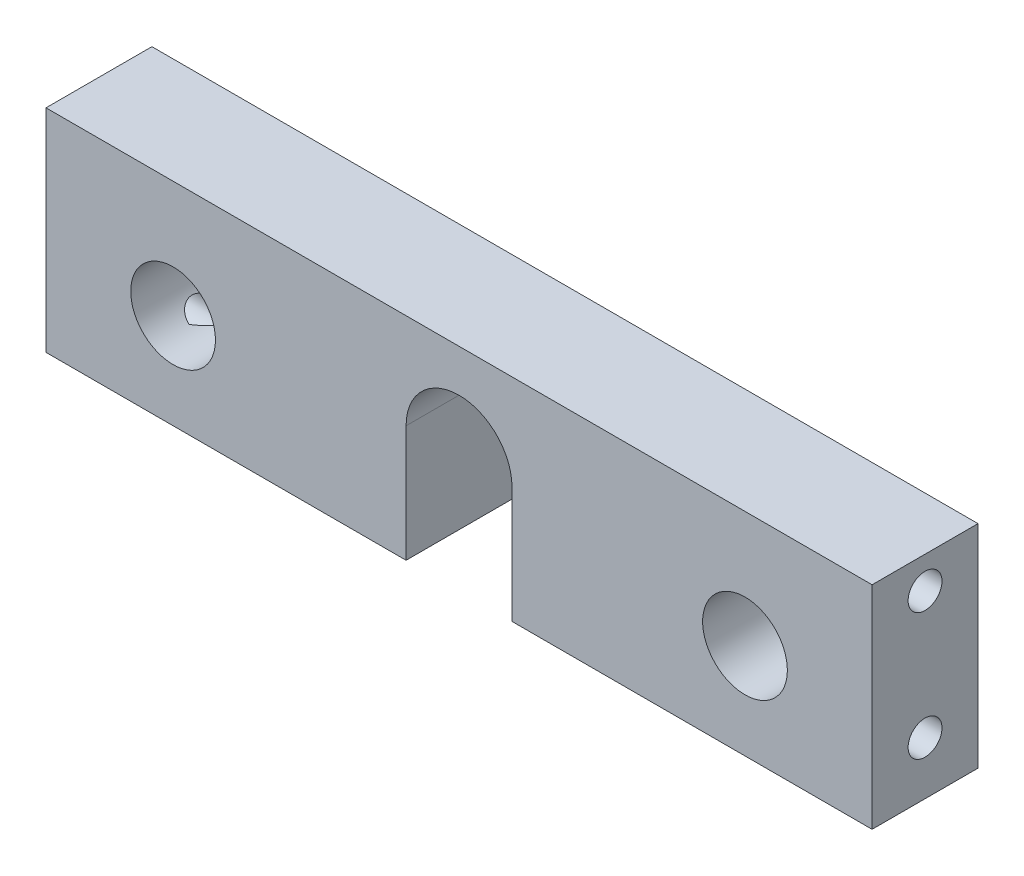
ISO-10303-21;
HEADER;
FILE_DESCRIPTION(('STEP AP214'),'2;1');
FILE_NAME('part.step','',(''),(''),'','','');
FILE_SCHEMA(('AUTOMOTIVE_DESIGN { 1 0 10303 214 1 1 1 1 }'));
ENDSEC;
DATA;
#1=APPLICATION_CONTEXT('core data for automotive mechanical design processes');
#2=APPLICATION_PROTOCOL_DEFINITION('international standard','automotive_design',2000,#1);
#3=PRODUCT_CONTEXT('',#1,'mechanical');
#4=PRODUCT('Part','Part','',(#3));
#5=PRODUCT_RELATED_PRODUCT_CATEGORY('part','',(#4));
#6=PRODUCT_DEFINITION_FORMATION('','',#4);
#7=PRODUCT_DEFINITION_CONTEXT('part definition',#1,'design');
#8=PRODUCT_DEFINITION('design','',#6,#7);
#9=PRODUCT_DEFINITION_SHAPE('','',#8);
#10=(LENGTH_UNIT() NAMED_UNIT(*) SI_UNIT(.MILLI.,.METRE.));
#11=(NAMED_UNIT(*) PLANE_ANGLE_UNIT() SI_UNIT($,.RADIAN.));
#12=(NAMED_UNIT(*) SI_UNIT($,.STERADIAN.) SOLID_ANGLE_UNIT());
#13=UNCERTAINTY_MEASURE_WITH_UNIT(LENGTH_MEASURE(1.E-05),#10,'distance_accuracy_value','');
#14=(GEOMETRIC_REPRESENTATION_CONTEXT(3) GLOBAL_UNCERTAINTY_ASSIGNED_CONTEXT((#13)) GLOBAL_UNIT_ASSIGNED_CONTEXT((#10,
#11,#12)) REPRESENTATION_CONTEXT('',''));
#15=CARTESIAN_POINT('',(0.,0.,0.));
#16=DIRECTION('',(0.,0.,1.));
#17=DIRECTION('',(1.,0.,0.));
#18=AXIS2_PLACEMENT_3D('',#15,#16,#17);
#19=CARTESIAN_POINT('',(39.,0.,2.5));
#20=DIRECTION('',(0.,1.,0.));
#21=DIRECTION('',(0.,0.,1.));
#22=AXIS2_PLACEMENT_3D('',#19,#20,#21);
#23=PLANE('',#22);
#24=DIRECTION('',(-1.,0.,0.));
#25=VECTOR('',#24,1.);
#26=CARTESIAN_POINT('',(39.,0.,-2.5));
#27=LINE('',#26,#25);
#28=CARTESIAN_POINT('',(17.,0.,-2.5));
#29=VERTEX_POINT('',#28);
#30=CARTESIAN_POINT('',(0.,0.,-2.5));
#31=VERTEX_POINT('',#30);
#32=EDGE_CURVE('E146',#29,#31,#27,.T.);
#33=ORIENTED_EDGE('',*,*,#32,.F.);
#34=DIRECTION('',(0.,0.,1.));
#35=VECTOR('',#34,1.);
#36=CARTESIAN_POINT('',(17.,0.,-2.501));
#37=LINE('',#36,#35);
#38=CARTESIAN_POINT('',(17.,0.,2.5));
#39=VERTEX_POINT('',#38);
#40=EDGE_CURVE('E133',#29,#39,#37,.T.);
#41=ORIENTED_EDGE('',*,*,#40,.T.);
#42=DIRECTION('',(-1.,0.,0.));
#43=VECTOR('',#42,1.);
#44=CARTESIAN_POINT('',(39.,0.,2.5));
#45=LINE('',#44,#43);
#46=CARTESIAN_POINT('',(0.,0.,2.5));
#47=VERTEX_POINT('',#46);
#48=EDGE_CURVE('E43',#39,#47,#45,.T.);
#49=ORIENTED_EDGE('',*,*,#48,.T.);
#50=DIRECTION('',(0.,0.,-1.));
#51=VECTOR('',#50,1.);
#52=CARTESIAN_POINT('',(0.,0.,2.5));
#53=LINE('',#52,#51);
#54=EDGE_CURVE('E160',#47,#31,#53,.T.);
#55=ORIENTED_EDGE('',*,*,#54,.T.);
#56=EDGE_LOOP('',(#33,#41,#49,#55));
#57=FACE_BOUND('',#56,.T.);
#58=ADVANCED_FACE('F35',(#57),#23,.F.);
#59=CARTESIAN_POINT('',(39.,0.,2.5));
#60=DIRECTION('',(0.,0.,-1.));
#61=DIRECTION('',(0.,1.,0.));
#62=AXIS2_PLACEMENT_3D('',#59,#60,#61);
#63=PLANE('',#62);
#64=CARTESIAN_POINT('',(33.,4.5,2.5));
#65=DIRECTION('',(0.,0.,1.));
#66=DIRECTION('',(1.,0.,0.));
#67=AXIS2_PLACEMENT_3D('',#64,#65,#66);
#68=CIRCLE('',#67,2.);
#69=CARTESIAN_POINT('',(35.,4.5,2.5));
#70=VERTEX_POINT('',#69);
#71=EDGE_CURVE('E132',#70,#70,#68,.T.);
#72=ORIENTED_EDGE('',*,*,#71,.F.);
#73=EDGE_LOOP('',(#72));
#74=FACE_BOUND('',#73,.T.);
#75=CARTESIAN_POINT('',(6.,4.5,2.5));
#76=DIRECTION('',(0.,0.,1.));
#77=DIRECTION('',(1.,0.,0.));
#78=AXIS2_PLACEMENT_3D('',#75,#76,#77);
#79=CIRCLE('',#78,2.);
#80=CARTESIAN_POINT('',(8.,4.5,2.5));
#81=VERTEX_POINT('',#80);
#82=EDGE_CURVE('E239',#81,#81,#79,.T.);
#83=ORIENTED_EDGE('',*,*,#82,.F.);
#84=EDGE_LOOP('',(#83));
#85=FACE_BOUND('',#84,.T.);
#86=ORIENTED_EDGE('',*,*,#48,.F.);
#87=DIRECTION('',(0.,-1.,0.));
#88=VECTOR('',#87,1.);
#89=CARTESIAN_POINT('',(17.,0.,2.5));
#90=LINE('',#89,#88);
#91=CARTESIAN_POINT('',(17.,5.5,2.5));
#92=VERTEX_POINT('',#91);
#93=EDGE_CURVE('E141',#92,#39,#90,.T.);
#94=ORIENTED_EDGE('',*,*,#93,.F.);
#95=CARTESIAN_POINT('',(19.5,5.5,2.5));
#96=DIRECTION('',(0.,0.,1.));
#97=DIRECTION('',(-1.,0.,0.));
#98=AXIS2_PLACEMENT_3D('',#95,#96,#97);
#99=CIRCLE('',#98,2.5);
#100=CARTESIAN_POINT('',(22.,5.5,2.5));
#101=VERTEX_POINT('',#100);
#102=EDGE_CURVE('E309',#101,#92,#99,.T.);
#103=ORIENTED_EDGE('',*,*,#102,.F.);
#104=DIRECTION('',(0.,1.,0.));
#105=VECTOR('',#104,1.);
#106=CARTESIAN_POINT('',(22.,5.5,2.5));
#107=LINE('',#106,#105);
#108=CARTESIAN_POINT('',(22.,0.,2.5));
#109=VERTEX_POINT('',#108);
#110=EDGE_CURVE('E307',#109,#101,#107,.T.);
#111=ORIENTED_EDGE('',*,*,#110,.F.);
#112=CARTESIAN_POINT('',(39.,0.,2.5));
#113=VERTEX_POINT('',#112);
#114=EDGE_CURVE('E11',#113,#109,#45,.T.);
#115=ORIENTED_EDGE('',*,*,#114,.F.);
#116=DIRECTION('',(0.,-1.,0.));
#117=VECTOR('',#116,1.);
#118=CARTESIAN_POINT('',(39.,0.,2.5));
#119=LINE('',#118,#117);
#120=CARTESIAN_POINT('',(39.,10.,2.5));
#121=VERTEX_POINT('',#120);
#122=EDGE_CURVE('E157',#121,#113,#119,.T.);
#123=ORIENTED_EDGE('',*,*,#122,.F.);
#124=DIRECTION('',(-1.,0.,0.));
#125=VECTOR('',#124,1.);
#126=CARTESIAN_POINT('',(39.,10.,2.5));
#127=LINE('',#126,#125);
#128=CARTESIAN_POINT('',(0.,10.,2.5));
#129=VERTEX_POINT('',#128);
#130=EDGE_CURVE('E151',#121,#129,#127,.T.);
#131=ORIENTED_EDGE('',*,*,#130,.T.);
#132=DIRECTION('',(0.,-1.,0.));
#133=VECTOR('',#132,1.);
#134=CARTESIAN_POINT('',(0.,0.,2.5));
#135=LINE('',#134,#133);
#136=EDGE_CURVE('E163',#129,#47,#135,.T.);
#137=ORIENTED_EDGE('',*,*,#136,.T.);
#138=EDGE_LOOP('',(#86,#94,#103,#111,#115,#123,#131,#137));
#139=FACE_BOUND('',#138,.T.);
#140=ADVANCED_FACE('F37',(#74,#85,#139),#63,.F.);
#141=ORIENTED_EDGE('',*,*,#114,.T.);
#142=DIRECTION('',(0.,0.,1.));
#143=VECTOR('',#142,1.);
#144=CARTESIAN_POINT('',(22.,0.,-2.501));
#145=LINE('',#144,#143);
#146=CARTESIAN_POINT('',(22.,0.,-2.5));
#147=VERTEX_POINT('',#146);
#148=EDGE_CURVE('E127',#147,#109,#145,.T.);
#149=ORIENTED_EDGE('',*,*,#148,.F.);
#150=CARTESIAN_POINT('',(39.,0.,-2.5));
#151=VERTEX_POINT('',#150);
#152=EDGE_CURVE('E138',#151,#147,#27,.T.);
#153=ORIENTED_EDGE('',*,*,#152,.F.);
#154=DIRECTION('',(0.,0.,-1.));
#155=VECTOR('',#154,1.);
#156=CARTESIAN_POINT('',(39.,0.,2.5));
#157=LINE('',#156,#155);
#158=EDGE_CURVE('E169',#113,#151,#157,.T.);
#159=ORIENTED_EDGE('',*,*,#158,.F.);
#160=EDGE_LOOP('',(#141,#149,#153,#159));
#161=FACE_BOUND('',#160,.T.);
#162=ADVANCED_FACE('F137',(#161),#23,.F.);
#163=CARTESIAN_POINT('',(39.,10.,-2.5));
#164=DIRECTION('',(0.,0.,1.));
#165=DIRECTION('',(0.,-1.,0.));
#166=AXIS2_PLACEMENT_3D('',#163,#164,#165);
#167=PLANE('',#166);
#168=CARTESIAN_POINT('',(33.,4.5,-2.5));
#169=DIRECTION('',(0.,0.,1.));
#170=DIRECTION('',(0.,-1.,0.));
#171=AXIS2_PLACEMENT_3D('',#168,#169,#170);
#172=CIRCLE('',#171,2.);
#173=CARTESIAN_POINT('',(33.,2.5,-2.5));
#174=VERTEX_POINT('',#173);
#175=EDGE_CURVE('E237',#174,#174,#172,.F.);
#176=ORIENTED_EDGE('',*,*,#175,.F.);
#177=EDGE_LOOP('',(#176));
#178=FACE_BOUND('',#177,.T.);
#179=CARTESIAN_POINT('',(6.,4.5,-2.5));
#180=DIRECTION('',(0.,0.,1.));
#181=DIRECTION('',(0.,-1.,0.));
#182=AXIS2_PLACEMENT_3D('',#179,#180,#181);
#183=CIRCLE('',#182,2.);
#184=CARTESIAN_POINT('',(6.,2.5,-2.5));
#185=VERTEX_POINT('',#184);
#186=EDGE_CURVE('E196',#185,#185,#183,.F.);
#187=ORIENTED_EDGE('',*,*,#186,.F.);
#188=EDGE_LOOP('',(#187));
#189=FACE_BOUND('',#188,.T.);
#190=CARTESIAN_POINT('',(19.5,5.5,-2.5));
#191=DIRECTION('',(0.,0.,1.));
#192=DIRECTION('',(0.,-1.,0.));
#193=AXIS2_PLACEMENT_3D('',#190,#191,#192);
#194=CIRCLE('',#193,2.5);
#195=CARTESIAN_POINT('',(17.,5.5,-2.5));
#196=VERTEX_POINT('',#195);
#197=CARTESIAN_POINT('',(22.,5.5,-2.5));
#198=VERTEX_POINT('',#197);
#199=EDGE_CURVE('E50',#196,#198,#194,.F.);
#200=ORIENTED_EDGE('',*,*,#199,.F.);
#201=DIRECTION('',(0.,1.,0.));
#202=VECTOR('',#201,1.);
#203=CARTESIAN_POINT('',(17.,0.,-2.5));
#204=LINE('',#203,#202);
#205=EDGE_CURVE('E279',#29,#196,#204,.T.);
#206=ORIENTED_EDGE('',*,*,#205,.F.);
#207=ORIENTED_EDGE('',*,*,#32,.T.);
#208=DIRECTION('',(0.,1.,0.));
#209=VECTOR('',#208,1.);
#210=CARTESIAN_POINT('',(0.,10.,-2.5));
#211=LINE('',#210,#209);
#212=CARTESIAN_POINT('',(0.,10.,-2.5));
#213=VERTEX_POINT('',#212);
#214=EDGE_CURVE('E158',#31,#213,#211,.T.);
#215=ORIENTED_EDGE('',*,*,#214,.T.);
#216=DIRECTION('',(-1.,0.,0.));
#217=VECTOR('',#216,1.);
#218=CARTESIAN_POINT('',(39.,10.,-2.5));
#219=LINE('',#218,#217);
#220=CARTESIAN_POINT('',(39.,10.,-2.5));
#221=VERTEX_POINT('',#220);
#222=EDGE_CURVE('E147',#221,#213,#219,.T.);
#223=ORIENTED_EDGE('',*,*,#222,.F.);
#224=DIRECTION('',(0.,1.,0.));
#225=VECTOR('',#224,1.);
#226=CARTESIAN_POINT('',(39.,10.,-2.5));
#227=LINE('',#226,#225);
#228=EDGE_CURVE('E145',#151,#221,#227,.T.);
#229=ORIENTED_EDGE('',*,*,#228,.F.);
#230=ORIENTED_EDGE('',*,*,#152,.T.);
#231=DIRECTION('',(0.,-1.,0.));
#232=VECTOR('',#231,1.);
#233=CARTESIAN_POINT('',(22.,5.5,-2.5));
#234=LINE('',#233,#232);
#235=EDGE_CURVE('E123',#198,#147,#234,.T.);
#236=ORIENTED_EDGE('',*,*,#235,.F.);
#237=EDGE_LOOP('',(#200,#206,#207,#215,#223,#229,#230,#236));
#238=FACE_BOUND('',#237,.T.);
#239=ADVANCED_FACE('F143',(#178,#189,#238),#167,.F.);
#240=CARTESIAN_POINT('',(39.,10.,2.5));
#241=DIRECTION('',(0.,-1.,0.));
#242=DIRECTION('',(0.,0.,-1.));
#243=AXIS2_PLACEMENT_3D('',#240,#241,#242);
#244=PLANE('',#243);
#245=DIRECTION('',(0.,0.,1.));
#246=VECTOR('',#245,1.);
#247=CARTESIAN_POINT('',(0.,10.,2.5));
#248=LINE('',#247,#246);
#249=EDGE_CURVE('E155',#213,#129,#248,.T.);
#250=ORIENTED_EDGE('',*,*,#249,.T.);
#251=ORIENTED_EDGE('',*,*,#130,.F.);
#252=DIRECTION('',(0.,0.,1.));
#253=VECTOR('',#252,1.);
#254=CARTESIAN_POINT('',(39.,10.,2.5));
#255=LINE('',#254,#253);
#256=EDGE_CURVE('E154',#221,#121,#255,.T.);
#257=ORIENTED_EDGE('',*,*,#256,.F.);
#258=ORIENTED_EDGE('',*,*,#222,.T.);
#259=EDGE_LOOP('',(#250,#251,#257,#258));
#260=FACE_BOUND('',#259,.T.);
#261=ADVANCED_FACE('F275',(#260),#244,.F.);
#262=CARTESIAN_POINT('',(39.,0.,0.));
#263=DIRECTION('',(-1.,0.,0.));
#264=DIRECTION('',(0.,0.,1.));
#265=AXIS2_PLACEMENT_3D('',#262,#263,#264);
#266=PLANE('',#265);
#267=CARTESIAN_POINT('',(39.,8.5,0.));
#268=DIRECTION('',(1.,0.,0.));
#269=DIRECTION('',(0.,0.,-1.));
#270=AXIS2_PLACEMENT_3D('',#267,#268,#269);
#271=CIRCLE('',#270,0.79999999999999);
#272=CARTESIAN_POINT('',(39.,8.5,-0.79999999999999));
#273=VERTEX_POINT('',#272);
#274=EDGE_CURVE('E181',#273,#273,#271,.T.);
#275=ORIENTED_EDGE('',*,*,#274,.F.);
#276=EDGE_LOOP('',(#275));
#277=FACE_BOUND('',#276,.T.);
#278=CARTESIAN_POINT('',(39.,2.5,0.));
#279=DIRECTION('',(1.,0.,0.));
#280=DIRECTION('',(0.,0.,-1.));
#281=AXIS2_PLACEMENT_3D('',#278,#279,#280);
#282=CIRCLE('',#281,0.79999999999999);
#283=CARTESIAN_POINT('',(39.,2.5,-0.79999999999999));
#284=VERTEX_POINT('',#283);
#285=EDGE_CURVE('E175',#284,#284,#282,.T.);
#286=ORIENTED_EDGE('',*,*,#285,.F.);
#287=EDGE_LOOP('',(#286));
#288=FACE_BOUND('',#287,.T.);
#289=ORIENTED_EDGE('',*,*,#122,.T.);
#290=ORIENTED_EDGE('',*,*,#158,.T.);
#291=ORIENTED_EDGE('',*,*,#228,.T.);
#292=ORIENTED_EDGE('',*,*,#256,.T.);
#293=EDGE_LOOP('',(#289,#290,#291,#292));
#294=FACE_BOUND('',#293,.T.);
#295=ADVANCED_FACE('F261',(#277,#288,#294),#266,.F.);
#296=CARTESIAN_POINT('',(0.,0.,0.));
#297=DIRECTION('',(-1.,0.,0.));
#298=DIRECTION('',(0.,0.,1.));
#299=AXIS2_PLACEMENT_3D('',#296,#297,#298);
#300=PLANE('',#299);
#301=CARTESIAN_POINT('',(0.,8.5,0.));
#302=DIRECTION('',(-1.,0.,0.));
#303=DIRECTION('',(0.,0.,1.));
#304=AXIS2_PLACEMENT_3D('',#301,#302,#303);
#305=CIRCLE('',#304,0.79999999999999);
#306=CARTESIAN_POINT('',(0.,8.5,0.79999999999999));
#307=VERTEX_POINT('',#306);
#308=EDGE_CURVE('E193',#307,#307,#305,.T.);
#309=ORIENTED_EDGE('',*,*,#308,.F.);
#310=EDGE_LOOP('',(#309));
#311=FACE_BOUND('',#310,.T.);
#312=CARTESIAN_POINT('',(0.,2.5,0.));
#313=DIRECTION('',(-1.,0.,0.));
#314=DIRECTION('',(0.,0.,1.));
#315=AXIS2_PLACEMENT_3D('',#312,#313,#314);
#316=CIRCLE('',#315,0.79999999999999);
#317=CARTESIAN_POINT('',(0.,2.5,0.79999999999999));
#318=VERTEX_POINT('',#317);
#319=EDGE_CURVE('E187',#318,#318,#316,.T.);
#320=ORIENTED_EDGE('',*,*,#319,.F.);
#321=EDGE_LOOP('',(#320));
#322=FACE_BOUND('',#321,.T.);
#323=ORIENTED_EDGE('',*,*,#136,.F.);
#324=ORIENTED_EDGE('',*,*,#249,.F.);
#325=ORIENTED_EDGE('',*,*,#214,.F.);
#326=ORIENTED_EDGE('',*,*,#54,.F.);
#327=EDGE_LOOP('',(#323,#324,#325,#326));
#328=FACE_BOUND('',#327,.T.);
#329=ADVANCED_FACE('F257',(#311,#322,#328),#300,.T.);
#330=CARTESIAN_POINT('',(34.,2.5,0.));
#331=DIRECTION('',(1.,0.,0.));
#332=DIRECTION('',(0.,0.,-1.));
#333=AXIS2_PLACEMENT_3D('',#330,#331,#332);
#334=CONICAL_SURFACE('',#333,0.799999999999999,1.02974425867665);
#335=CARTESIAN_POINT('',(33.519311504778,2.5,0.));
#336=VERTEX_POINT('',#335);
#337=VERTEX_LOOP('',#336);
#338=FACE_BOUND('',#337,.T.);
#339=CARTESIAN_POINT('',(34.,2.5,0.));
#340=DIRECTION('',(1.,0.,0.));
#341=DIRECTION('',(0.,0.,-1.));
#342=AXIS2_PLACEMENT_3D('',#339,#340,#341);
#343=CIRCLE('',#342,0.799999999999999);
#344=CARTESIAN_POINT('',(34.,2.76794919243112,0.753792564486748));
#345=VERTEX_POINT('',#344);
#346=CARTESIAN_POINT('',(34.,2.76794919243112,-0.753792564486748));
#347=VERTEX_POINT('',#346);
#348=EDGE_CURVE('E166',#345,#347,#343,.T.);
#349=ORIENTED_EDGE('',*,*,#348,.T.);
#350=CARTESIAN_POINT('',(34.0482688495222,2.79672890615692,0.828817165255253));
#351=CARTESIAN_POINT('',(34.0158658392138,2.77679246989616,0.778655058078015));
#352=CARTESIAN_POINT('',(33.9834335759256,2.75810109130706,0.728025460936995));
#353=CARTESIAN_POINT('',(33.9186116656186,2.72306047942735,0.625999383879463));
#354=CARTESIAN_POINT('',(33.8862220058319,2.70670926447969,0.574603593994948));
#355=CARTESIAN_POINT('',(33.8324059482657,2.68130185025187,0.488522365164077));
#356=CARTESIAN_POINT('',(33.8109548587628,2.67164129943077,0.454028425128806));
#357=CARTESIAN_POINT('',(33.7681381237355,2.65324436845889,0.384742769041029));
#358=CARTESIAN_POINT('',(33.7467724749181,2.64450795235321,0.349951064630474));
#359=CARTESIAN_POINT('',(33.7120500247226,2.63099121118274,0.292830831054498));
#360=CARTESIAN_POINT('',(33.6986274163005,2.62593433101073,0.270607087382298));
#361=CARTESIAN_POINT('',(33.6719675872282,2.61621131597223,0.225996674295367));
#362=CARTESIAN_POINT('',(33.6587301734436,2.61154474409807,0.203610218445247));
#363=CARTESIAN_POINT('',(33.6376560390068,2.60435564095472,0.167104490119692));
#364=CARTESIAN_POINT('',(33.6296854297108,2.60169430322372,0.153089223779013));
#365=CARTESIAN_POINT('',(33.614046326589,2.59657828493544,0.124783897839913));
#366=CARTESIAN_POINT('',(33.6063789011998,2.594124305625,0.110493091969524));
#367=CARTESIAN_POINT('',(33.5937610826339,2.59016241875303,0.0852153025961971));
#368=CARTESIAN_POINT('',(33.5886222508864,2.58857433630389,0.0743343166005532));
#369=CARTESIAN_POINT('',(33.5793972573135,2.58575834437404,0.0520957095727081));
#370=CARTESIAN_POINT('',(33.5753056038604,2.58452855103914,0.0407409540989717));
#371=CARTESIAN_POINT('',(33.5708500033387,2.58319694600732,0.0218433167210185));
#372=CARTESIAN_POINT('',(33.5696548476613,2.58284235370876,0.0145384615684506));
#373=CARTESIAN_POINT('',(33.5687326608797,2.58256850549017,-0.000143586367138592));
#374=CARTESIAN_POINT('',(33.5689973686777,2.58264679995029,-0.00752013679046631));
#375=CARTESIAN_POINT('',(33.5711350651502,2.58328253102752,-0.024322050642942));
#376=CARTESIAN_POINT('',(33.5734815809327,2.58398109642157,-0.0336729624409168));
#377=CARTESIAN_POINT('',(33.5793954260834,2.58576113104446,-0.0520292075728829));
#378=CARTESIAN_POINT('',(33.5829794750542,2.58684785172984,-0.0610278236259892));
#379=CARTESIAN_POINT('',(33.5911674417922,2.58936093034759,-0.0797679504308452));
#380=CARTESIAN_POINT('',(33.5958414173316,2.59081205398041,-0.0894746943046911));
#381=CARTESIAN_POINT('',(33.6055413401088,2.59386627276231,-0.108688490881402));
#382=CARTESIAN_POINT('',(33.6105675085287,2.59546946363934,-0.118195413133031));
#383=CARTESIAN_POINT('',(33.6259377326229,2.60044282880207,-0.146567001386313));
#384=CARTESIAN_POINT('',(33.6365588430403,2.60397233663063,-0.165252587973573));
#385=CARTESIAN_POINT('',(33.6580126084942,2.61131040195198,-0.202311829980062));
#386=CARTESIAN_POINT('',(33.6688439170213,2.61511745298719,-0.220686586948556));
#387=CARTESIAN_POINT('',(33.6906337774139,2.62299201184342,-0.257279100813683));
#388=CARTESIAN_POINT('',(33.7015921927119,2.62705925811582,-0.275496995115586));
#389=CARTESIAN_POINT('',(33.7402421681236,2.64179733724308,-0.339373884074657));
#390=CARTESIAN_POINT('',(33.7681187799988,2.65313262334938,-0.384769001657985));
#391=CARTESIAN_POINT('',(33.8240087756408,2.67738105718805,-0.47508262741215));
#392=CARTESIAN_POINT('',(33.8520222216637,2.69029500311407,-0.520000881895671));
#393=CARTESIAN_POINT('',(33.9080820364308,2.7177649918015,-0.60928165538766));
#394=CARTESIAN_POINT('',(33.9361283823319,2.732320227245,-0.65364443579479));
#395=CARTESIAN_POINT('',(33.9922122452274,2.76318231556788,-0.741728116417772));
#396=CARTESIAN_POINT('',(34.0202497598566,2.77948831069369,-0.785449319136255));
#397=CARTESIAN_POINT('',(34.0482688495222,2.79672890615691,-0.828817165255261));
#398=B_SPLINE_CURVE_WITH_KNOTS('',3,(#350,#351,#352,#353,#354,#355,#356,#357,#358,#359,#360,
#361,#362,#363,#364,#365,#366,#367,#368,#369,#370,#371,#372,#373,#374,#375,#376,#377,#378,#379,
#380,#381,#382,#383,#384,#385,#386,#387,#388,#389,#390,#391,#392,#393,#394,#395,#396,#397),
.UNSPECIFIED.,.F.,.F.,(4,2,2,2,2,2,2,2,2,2,2,2,2,2,2,2,2,2,2,2,2,2,2,4),(0.,0.188849795921918,
0.377538714917223,0.502787986298943,0.628032382871921,0.707382016895445,0.786641583614198,
0.835665771112241,0.884849615684218,0.921258388741007,0.95747212196251,0.979579752033602,
1.00156240793879,1.03036575267037,1.05957454212747,1.09216844918665,1.1247830123807,
1.19011282641448,1.25511122114414,1.32004527592421,1.48340814381423,1.64685395468971,
1.81021971763301,1.97350580452616),.UNSPECIFIED.);
#399=EDGE_CURVE('E57',#345,#347,#398,.T.);
#400=ORIENTED_EDGE('',*,*,#399,.F.);
#401=EDGE_LOOP('',(#349,#400));
#402=FACE_BOUND('',#401,.T.);
#403=ADVANCED_FACE('F260',(#338,#402),#334,.F.);
#404=CARTESIAN_POINT('',(39.,2.5,0.));
#405=DIRECTION('',(1.,0.,0.));
#406=DIRECTION('',(0.,0.,-1.));
#407=AXIS2_PLACEMENT_3D('',#404,#405,#406);
#408=CYLINDRICAL_SURFACE('',#407,0.799999999999994);
#409=ORIENTED_EDGE('',*,*,#348,.F.);
#410=CARTESIAN_POINT('',(34.,2.76794919243112,-0.753792564486744));
#411=CARTESIAN_POINT('',(34.0287584945203,2.78454328832557,-0.747886673149369));
#412=CARTESIAN_POINT('',(34.0569845663212,2.80180378637738,-0.741140012139985));
#413=CARTESIAN_POINT('',(34.1122346075392,2.83746889119155,-0.725601432350524));
#414=CARTESIAN_POINT('',(34.1392549794201,2.85587657410959,-0.716803824459315));
#415=CARTESIAN_POINT('',(34.1920337434566,2.89372452731614,-0.696737191555022));
#416=CARTESIAN_POINT('',(34.2177782638942,2.91317272931792,-0.685446207620992));
#417=CARTESIAN_POINT('',(34.2674331019855,2.95254514120625,-0.660114110862817));
#418=CARTESIAN_POINT('',(34.2913457228808,2.97246871063993,-0.646076532996738));
#419=CARTESIAN_POINT('',(34.3442336424648,3.01857662298186,-0.610064664227451));
#420=CARTESIAN_POINT('',(34.3724613675159,3.04477527602998,-0.586980541055674));
#421=CARTESIAN_POINT('',(34.4245365407411,3.09571380398334,-0.535198007171804));
#422=CARTESIAN_POINT('',(34.4484002020798,3.12045883659465,-0.506521230344962));
#423=CARTESIAN_POINT('',(34.4914745302864,3.16713693705029,-0.443266753798868));
#424=CARTESIAN_POINT('',(34.5106394777548,3.1890414677502,-0.408636253153584));
#425=CARTESIAN_POINT('',(34.5435763528064,3.22798240685204,-0.334359935572683));
#426=CARTESIAN_POINT('',(34.5573465553481,3.24501725763907,-0.294712519764474));
#427=CARTESIAN_POINT('',(34.5778724772782,3.27095251305349,-0.217014841487699));
#428=CARTESIAN_POINT('',(34.5852919891479,3.28060587679282,-0.179389436578017));
#429=CARTESIAN_POINT('',(34.5957756855161,3.294356298965,-0.102557629490005));
#430=CARTESIAN_POINT('',(34.5988424891163,3.29845669864664,-0.0633521926640497));
#431=CARTESIAN_POINT('',(34.6005504907098,3.30073410762176,0.0123910810613856));
#432=CARTESIAN_POINT('',(34.5995039855671,3.29932913023737,0.0489103650711547));
#433=CARTESIAN_POINT('',(34.5936811323921,3.29161113468077,0.121116320525222));
#434=CARTESIAN_POINT('',(34.5889055823478,3.28529916656964,0.156803168422249));
#435=CARTESIAN_POINT('',(34.5756993561279,3.26821853899377,0.226058186144665));
#436=CARTESIAN_POINT('',(34.5672990374325,3.2574869274004,0.259641355960506));
#437=CARTESIAN_POINT('',(34.5469144344204,3.23219945563662,0.324168956121505));
#438=CARTESIAN_POINT('',(34.5349296492374,3.21764306105434,0.355113016920314));
#439=CARTESIAN_POINT('',(34.5069449445985,3.18485823593478,0.414946748398142));
#440=CARTESIAN_POINT('',(34.4907990518265,3.16650249704358,0.443697889843039));
#441=CARTESIAN_POINT('',(34.455045197367,3.12757775852222,0.497235844369192));
#442=CARTESIAN_POINT('',(34.4354373214039,3.10700881369962,0.522022755582385));
#443=CARTESIAN_POINT('',(34.385486200496,3.05706095901185,0.575732041939408));
#444=CARTESIAN_POINT('',(34.3538158145105,3.02716981457288,0.602945411508528));
#445=CARTESIAN_POINT('',(34.2856178870887,2.96727036919317,0.650485392990916));
#446=CARTESIAN_POINT('',(34.2490725074574,2.9372620508705,0.670785690598581));
#447=CARTESIAN_POINT('',(34.1778051100339,2.88306584173946,0.702926706013557));
#448=CARTESIAN_POINT('',(34.1435918874709,2.85866650102443,0.715568651759519));
#449=CARTESIAN_POINT('',(34.0731977693747,2.8117924909133,0.737182162532327));
#450=CARTESIAN_POINT('',(34.037035670764,2.78930346279852,0.746183468495433));
#451=CARTESIAN_POINT('',(34.,2.76794919243112,0.753792564486744));
#452=B_SPLINE_CURVE_WITH_KNOTS('',3,(#410,#411,#412,#413,#414,#415,#416,#417,#418,#419,#420,
#421,#422,#423,#424,#425,#426,#427,#428,#429,#430,#431,#432,#433,#434,#435,#436,#437,#438,#439,
#440,#441,#442,#443,#444,#445,#446,#447,#448,#449,#450,#451),.UNSPECIFIED.,.F.,.F.,(4,2,2,2,2,2,
2,2,2,2,2,2,2,2,2,2,2,2,2,2,4),(0.,0.101182088344745,0.20264825686981,0.305046443024369,
0.407313696057408,0.541481888682452,0.675141024116912,0.810053218774685,0.945008518260312,
1.06301330688117,1.1809470597814,1.29010631360792,1.39924221455908,1.5074813204409,
1.61573555791347,1.7284818459162,1.84122534252587,1.99443612163648,2.14822373732971,
2.27962793376096,2.4099358667352),.UNSPECIFIED.);
#453=EDGE_CURVE('E227',#347,#345,#452,.T.);
#454=ORIENTED_EDGE('',*,*,#453,.F.);
#455=EDGE_LOOP('',(#409,#454));
#456=FACE_BOUND('',#455,.T.);
#457=ORIENTED_EDGE('',*,*,#285,.T.);
#458=EDGE_LOOP('',(#457));
#459=FACE_BOUND('',#458,.T.);
#460=ADVANCED_FACE('F295',(#456,#459),#408,.F.);
#461=CARTESIAN_POINT('',(34.,8.5,0.));
#462=DIRECTION('',(1.,0.,0.));
#463=DIRECTION('',(0.,0.,-1.));
#464=AXIS2_PLACEMENT_3D('',#461,#462,#463);
#465=CONICAL_SURFACE('',#464,0.799999999999999,1.02974425867665);
#466=CARTESIAN_POINT('',(33.519311504778,8.5,0.));
#467=VERTEX_POINT('',#466);
#468=VERTEX_LOOP('',#467);
#469=FACE_BOUND('',#468,.T.);
#470=CARTESIAN_POINT('',(34.,8.5,0.));
#471=DIRECTION('',(1.,0.,0.));
#472=DIRECTION('',(0.,0.,-1.));
#473=AXIS2_PLACEMENT_3D('',#470,#471,#472);
#474=CIRCLE('',#473,0.799999999999999);
#475=CARTESIAN_POINT('',(34.,8.5,-0.799999999999999));
#476=VERTEX_POINT('',#475);
#477=EDGE_CURVE('E178',#476,#476,#474,.T.);
#478=ORIENTED_EDGE('',*,*,#477,.T.);
#479=EDGE_LOOP('',(#478));
#480=FACE_BOUND('',#479,.T.);
#481=ADVANCED_FACE('F298',(#469,#480),#465,.F.);
#482=CARTESIAN_POINT('',(39.,8.5,0.));
#483=DIRECTION('',(1.,0.,0.));
#484=DIRECTION('',(0.,0.,-1.));
#485=AXIS2_PLACEMENT_3D('',#482,#483,#484);
#486=CYLINDRICAL_SURFACE('',#485,0.799999999999994);
#487=ORIENTED_EDGE('',*,*,#477,.F.);
#488=EDGE_LOOP('',(#487));
#489=FACE_BOUND('',#488,.T.);
#490=ORIENTED_EDGE('',*,*,#274,.T.);
#491=EDGE_LOOP('',(#490));
#492=FACE_BOUND('',#491,.T.);
#493=ADVANCED_FACE('F345',(#489,#492),#486,.F.);
#494=CARTESIAN_POINT('',(5.,2.5,0.));
#495=DIRECTION('',(-1.,0.,0.));
#496=DIRECTION('',(0.,0.,1.));
#497=AXIS2_PLACEMENT_3D('',#494,#495,#496);
#498=CONICAL_SURFACE('',#497,0.799999999999988,1.02974425867665);
#499=CARTESIAN_POINT('',(5.48068849522205,2.5,0.));
#500=VERTEX_POINT('',#499);
#501=VERTEX_LOOP('',#500);
#502=FACE_BOUND('',#501,.T.);
#503=CARTESIAN_POINT('',(5.,2.5,0.));
#504=DIRECTION('',(-1.,0.,0.));
#505=DIRECTION('',(0.,0.,1.));
#506=AXIS2_PLACEMENT_3D('',#503,#504,#505);
#507=CIRCLE('',#506,0.799999999999988);
#508=CARTESIAN_POINT('',(5.,2.76794919243112,-0.753792564486737));
#509=VERTEX_POINT('',#508);
#510=CARTESIAN_POINT('',(5.,2.76794919243112,0.753792564486737));
#511=VERTEX_POINT('',#510);
#512=EDGE_CURVE('E184',#509,#511,#507,.T.);
#513=ORIENTED_EDGE('',*,*,#512,.T.);
#514=CARTESIAN_POINT('',(4.9517311504778,2.79672890615692,-0.82881716525524));
#515=CARTESIAN_POINT('',(4.98413416078622,2.77679246989616,-0.778655058078002));
#516=CARTESIAN_POINT('',(5.01656642407441,2.75810109130706,-0.728025460936984));
#517=CARTESIAN_POINT('',(5.08138833438139,2.72306047942735,-0.625999383879453));
#518=CARTESIAN_POINT('',(5.11377799416806,2.70670926447969,-0.574603593994937));
#519=CARTESIAN_POINT('',(5.16759405173431,2.68130185025187,-0.488522365164066));
#520=CARTESIAN_POINT('',(5.1890451412372,2.67164129943077,-0.454028425128795));
#521=CARTESIAN_POINT('',(5.23186187626447,2.65324436845889,-0.38474276904102));
#522=CARTESIAN_POINT('',(5.25322752508191,2.64450795235322,-0.349951064630465));
#523=CARTESIAN_POINT('',(5.28794997527737,2.63099121118275,-0.292830831054488));
#524=CARTESIAN_POINT('',(5.30137258369953,2.62593433101074,-0.270607087382287));
#525=CARTESIAN_POINT('',(5.3280324127718,2.61621131597224,-0.225996674295356));
#526=CARTESIAN_POINT('',(5.34126982655638,2.61154474409808,-0.203610218445236));
#527=CARTESIAN_POINT('',(5.36234396099325,2.60435564095472,-0.167104490119682));
#528=CARTESIAN_POINT('',(5.37031457028924,2.60169430322372,-0.153089223779003));
#529=CARTESIAN_POINT('',(5.38595367341098,2.59657828493544,-0.124783897839904));
#530=CARTESIAN_POINT('',(5.39362109880021,2.594124305625,-0.110493091969517));
#531=CARTESIAN_POINT('',(5.40623891736616,2.59016241875303,-0.0852153025961925));
#532=CARTESIAN_POINT('',(5.41137774911361,2.5885743363039,-0.0743343166005498));
#533=CARTESIAN_POINT('',(5.4206027426865,2.58575834437405,-0.0520957095727062));
#534=CARTESIAN_POINT('',(5.42469439613959,2.58452855103914,-0.0407409540989701));
#535=CARTESIAN_POINT('',(5.42914999666133,2.58319694600732,-0.0218433167210179));
#536=CARTESIAN_POINT('',(5.43034515233874,2.58284235370877,-0.0145384615684502));
#537=CARTESIAN_POINT('',(5.43126733912034,2.58256850549017,0.000143586367138879));
#538=CARTESIAN_POINT('',(5.4310026313223,2.58264679995029,0.00752013679046659));
#539=CARTESIAN_POINT('',(5.4288649348498,2.58328253102752,0.024322050642942));
#540=CARTESIAN_POINT('',(5.4265184190673,2.58398109642157,0.0336729624409166));
#541=CARTESIAN_POINT('',(5.42060457391662,2.58576113104447,0.0520292075728829));
#542=CARTESIAN_POINT('',(5.41702052494584,2.58684785172984,0.0610278236259897));
#543=CARTESIAN_POINT('',(5.40883255820781,2.5893609303476,0.0797679504308458));
#544=CARTESIAN_POINT('',(5.40415858266839,2.59081205398042,0.0894746943046914));
#545=CARTESIAN_POINT('',(5.39445865989118,2.59386627276231,0.108688490881402));
#546=CARTESIAN_POINT('',(5.38943249147127,2.59546946363934,0.118195413133031));
#547=CARTESIAN_POINT('',(5.37406226737711,2.60044282880207,0.146567001386314));
#548=CARTESIAN_POINT('',(5.36344115695968,2.60397233663064,0.165252587973573));
#549=CARTESIAN_POINT('',(5.34198739150581,2.61131040195199,0.202311829980063));
#550=CARTESIAN_POINT('',(5.33115608297866,2.6151174529872,0.220686586948558));
#551=CARTESIAN_POINT('',(5.30936622258614,2.62299201184343,0.257279100813686));
#552=CARTESIAN_POINT('',(5.29840780728808,2.62705925811582,0.275496995115589));
#553=CARTESIAN_POINT('',(5.25975783187636,2.64179733724309,0.339373884074657));
#554=CARTESIAN_POINT('',(5.23188122000122,2.65313262334938,0.384769001657985));
#555=CARTESIAN_POINT('',(5.17599122435924,2.67738105718806,0.475082627412146));
#556=CARTESIAN_POINT('',(5.14797777833633,2.69029500311407,0.520000881895666));
#557=CARTESIAN_POINT('',(5.09191796356919,2.7177649918015,0.609281655387653));
#558=CARTESIAN_POINT('',(5.06387161766815,2.732320227245,0.653644435794783));
#559=CARTESIAN_POINT('',(5.00778775477262,2.76318231556788,0.741728116417762));
#560=CARTESIAN_POINT('',(4.97975024014342,2.7794883106937,0.785449319136244));
#561=CARTESIAN_POINT('',(4.95173115047781,2.79672890615691,0.828817165255247));
#562=B_SPLINE_CURVE_WITH_KNOTS('',3,(#514,#515,#516,#517,#518,#519,#520,#521,#522,#523,#524,
#525,#526,#527,#528,#529,#530,#531,#532,#533,#534,#535,#536,#537,#538,#539,#540,#541,#542,#543,
#544,#545,#546,#547,#548,#549,#550,#551,#552,#553,#554,#555,#556,#557,#558,#559,#560,#561),
.UNSPECIFIED.,.F.,.F.,(4,2,2,2,2,2,2,2,2,2,2,2,2,2,2,2,2,2,2,2,2,2,2,4),(0.,0.188849795921915,
0.377538714917221,0.502787986298937,0.628032382871916,0.707382016895441,0.786641583614193,
0.835665771112236,0.88484961568421,0.921258388740993,0.957472121962493,0.979579752033585,
1.00156240793877,1.03036575267035,1.05957454212746,1.09216844918663,1.12478301238068,
1.19011282641447,1.25511122114412,1.3200452759242,1.4834081438142,1.64685395468969,
1.81021971763298,1.97350580452613),.UNSPECIFIED.);
#563=EDGE_CURVE('E199',#509,#511,#562,.T.);
#564=ORIENTED_EDGE('',*,*,#563,.F.);
#565=EDGE_LOOP('',(#513,#564));
#566=FACE_BOUND('',#565,.T.);
#567=ADVANCED_FACE('F249',(#502,#566),#498,.F.);
#568=CARTESIAN_POINT('',(0.,2.5,0.));
#569=DIRECTION('',(-1.,0.,0.));
#570=DIRECTION('',(0.,0.,1.));
#571=AXIS2_PLACEMENT_3D('',#568,#569,#570);
#572=CYLINDRICAL_SURFACE('',#571,0.799999999999989);
#573=ORIENTED_EDGE('',*,*,#512,.F.);
#574=CARTESIAN_POINT('',(5.,2.76794919243112,0.753792564486738));
#575=CARTESIAN_POINT('',(4.97124150547975,2.78454328832557,0.747886673149364));
#576=CARTESIAN_POINT('',(4.94301543367877,2.80180378637738,0.74114001213998));
#577=CARTESIAN_POINT('',(4.88776539246077,2.83746889119155,0.725601432350519));
#578=CARTESIAN_POINT('',(4.86074502057988,2.85587657410958,0.71680382445931));
#579=CARTESIAN_POINT('',(4.80796625654338,2.89372452731614,0.696737191555018));
#580=CARTESIAN_POINT('',(4.78222173610586,2.91317272931791,0.685446207620988));
#581=CARTESIAN_POINT('',(4.73256689801454,2.95254514120624,0.660114110862812));
#582=CARTESIAN_POINT('',(4.70865427711922,2.97246871063993,0.646076532996733));
#583=CARTESIAN_POINT('',(4.65576635753517,3.01857662298186,0.610064664227445));
#584=CARTESIAN_POINT('',(4.62753863248414,3.04477527602998,0.586980541055668));
#585=CARTESIAN_POINT('',(4.57546345925894,3.09571380398334,0.535198007171798));
#586=CARTESIAN_POINT('',(4.5515997979202,3.12045883659465,0.506521230344956));
#587=CARTESIAN_POINT('',(4.50852546971356,3.16713693705029,0.443266753798862));
#588=CARTESIAN_POINT('',(4.48936052224519,3.1890414677502,0.408636253153578));
#589=CARTESIAN_POINT('',(4.4564236471936,3.22798240685204,0.334359935572674));
#590=CARTESIAN_POINT('',(4.44265344465189,3.24501725763906,0.294712519764465));
#591=CARTESIAN_POINT('',(4.42212752272185,3.27095251305348,0.217014841487689));
#592=CARTESIAN_POINT('',(4.41470801085214,3.28060587679282,0.179389436578009));
#593=CARTESIAN_POINT('',(4.40422431448393,3.294356298965,0.10255762949));
#594=CARTESIAN_POINT('',(4.40115751088368,3.29845669864664,0.0633521926640448));
#595=CARTESIAN_POINT('',(4.39944950929022,3.30073410762176,-0.0123910810613894));
#596=CARTESIAN_POINT('',(4.40049601443287,3.29932913023737,-0.0489103650711583));
#597=CARTESIAN_POINT('',(4.40631886760791,3.29161113468076,-0.121116320525226));
#598=CARTESIAN_POINT('',(4.41109441765219,3.28529916656963,-0.156803168422252));
#599=CARTESIAN_POINT('',(4.42430064387207,3.26821853899377,-0.226058186144668));
#600=CARTESIAN_POINT('',(4.43270096256748,3.2574869274004,-0.259641355960508));
#601=CARTESIAN_POINT('',(4.45308556557957,3.23219945563662,-0.324168956121505));
#602=CARTESIAN_POINT('',(4.46507035076265,3.21764306105434,-0.355113016920315));
#603=CARTESIAN_POINT('',(4.49305505540149,3.18485823593477,-0.414946748398143));
#604=CARTESIAN_POINT('',(4.50920094817347,3.16650249704358,-0.44369788984304));
#605=CARTESIAN_POINT('',(4.544954802633,3.12757775852222,-0.497235844369192));
#606=CARTESIAN_POINT('',(4.56456267859612,3.10700881369962,-0.522022755582384));
#607=CARTESIAN_POINT('',(4.61451379950397,3.05706095901184,-0.575732041939407));
#608=CARTESIAN_POINT('',(4.64618418548956,3.02716981457287,-0.602945411508527));
#609=CARTESIAN_POINT('',(4.7143821129113,2.96727036919317,-0.650485392990913));
#610=CARTESIAN_POINT('',(4.75092749254257,2.9372620508705,-0.670785690598577));
#611=CARTESIAN_POINT('',(4.82219488996608,2.88306584173946,-0.702926706013552));
#612=CARTESIAN_POINT('',(4.8564081125291,2.85866650102443,-0.715568651759514));
#613=CARTESIAN_POINT('',(4.92680223062532,2.81179249091329,-0.737182162532322));
#614=CARTESIAN_POINT('',(4.962964329236,2.78930346279852,-0.746183468495429));
#615=CARTESIAN_POINT('',(5.,2.76794919243112,-0.753792564486738));
#616=B_SPLINE_CURVE_WITH_KNOTS('',3,(#574,#575,#576,#577,#578,#579,#580,#581,#582,#583,#584,
#585,#586,#587,#588,#589,#590,#591,#592,#593,#594,#595,#596,#597,#598,#599,#600,#601,#602,#603,
#604,#605,#606,#607,#608,#609,#610,#611,#612,#613,#614,#615),.UNSPECIFIED.,.F.,.F.,(4,2,2,2,2,2,
2,2,2,2,2,2,2,2,2,2,2,2,2,2,4),(0.,0.101182088344744,0.202648256869809,0.305046443024366,
0.407313696057407,0.541481888682451,0.675141024116914,0.810053218774686,0.945008518260315,
1.06301330688117,1.1809470597814,1.29010631360791,1.39924221455908,1.5074813204409,
1.61573555791347,1.72848184591619,1.84122534252587,1.99443612163648,2.1482237373297,
2.27962793376094,2.40993586673518),.UNSPECIFIED.);
#617=EDGE_CURVE('E206',#511,#509,#616,.T.);
#618=ORIENTED_EDGE('',*,*,#617,.F.);
#619=EDGE_LOOP('',(#573,#618));
#620=FACE_BOUND('',#619,.T.);
#621=ORIENTED_EDGE('',*,*,#319,.T.);
#622=EDGE_LOOP('',(#621));
#623=FACE_BOUND('',#622,.T.);
#624=ADVANCED_FACE('F250',(#620,#623),#572,.F.);
#625=CARTESIAN_POINT('',(5.,8.5,0.));
#626=DIRECTION('',(-1.,0.,0.));
#627=DIRECTION('',(0.,0.,1.));
#628=AXIS2_PLACEMENT_3D('',#625,#626,#627);
#629=CONICAL_SURFACE('',#628,0.799999999999988,1.02974425867665);
#630=CARTESIAN_POINT('',(5.48068849522205,8.5,0.));
#631=VERTEX_POINT('',#630);
#632=VERTEX_LOOP('',#631);
#633=FACE_BOUND('',#632,.T.);
#634=CARTESIAN_POINT('',(5.,8.5,0.));
#635=DIRECTION('',(-1.,0.,0.));
#636=DIRECTION('',(0.,0.,1.));
#637=AXIS2_PLACEMENT_3D('',#634,#635,#636);
#638=CIRCLE('',#637,0.799999999999988);
#639=CARTESIAN_POINT('',(5.,8.5,0.799999999999988));
#640=VERTEX_POINT('',#639);
#641=EDGE_CURVE('E190',#640,#640,#638,.T.);
#642=ORIENTED_EDGE('',*,*,#641,.T.);
#643=EDGE_LOOP('',(#642));
#644=FACE_BOUND('',#643,.T.);
#645=ADVANCED_FACE('F253',(#633,#644),#629,.F.);
#646=CARTESIAN_POINT('',(0.,8.5,0.));
#647=DIRECTION('',(-1.,0.,0.));
#648=DIRECTION('',(0.,0.,1.));
#649=AXIS2_PLACEMENT_3D('',#646,#647,#648);
#650=CYLINDRICAL_SURFACE('',#649,0.799999999999989);
#651=ORIENTED_EDGE('',*,*,#641,.F.);
#652=EDGE_LOOP('',(#651));
#653=FACE_BOUND('',#652,.T.);
#654=ORIENTED_EDGE('',*,*,#308,.T.);
#655=EDGE_LOOP('',(#654));
#656=FACE_BOUND('',#655,.T.);
#657=ADVANCED_FACE('F354',(#653,#656),#650,.F.);
#658=CARTESIAN_POINT('',(6.,4.5,-2.501));
#659=DIRECTION('',(0.,0.,1.));
#660=DIRECTION('',(1.,0.,0.));
#661=AXIS2_PLACEMENT_3D('',#658,#659,#660);
#662=CYLINDRICAL_SURFACE('',#661,2.);
#663=ORIENTED_EDGE('',*,*,#563,.T.);
#664=ORIENTED_EDGE('',*,*,#617,.T.);
#665=EDGE_LOOP('',(#663,#664));
#666=FACE_BOUND('',#665,.T.);
#667=ORIENTED_EDGE('',*,*,#82,.T.);
#668=EDGE_LOOP('',(#667));
#669=FACE_BOUND('',#668,.T.);
#670=ORIENTED_EDGE('',*,*,#186,.T.);
#671=EDGE_LOOP('',(#670));
#672=FACE_BOUND('',#671,.T.);
#673=ADVANCED_FACE('F212',(#666,#669,#672),#662,.F.);
#674=CARTESIAN_POINT('',(33.,4.5,-2.501));
#675=DIRECTION('',(0.,0.,1.));
#676=DIRECTION('',(1.,0.,0.));
#677=AXIS2_PLACEMENT_3D('',#674,#675,#676);
#678=CYLINDRICAL_SURFACE('',#677,2.);
#679=ORIENTED_EDGE('',*,*,#399,.T.);
#680=ORIENTED_EDGE('',*,*,#453,.T.);
#681=EDGE_LOOP('',(#679,#680));
#682=FACE_BOUND('',#681,.T.);
#683=ORIENTED_EDGE('',*,*,#71,.T.);
#684=EDGE_LOOP('',(#683));
#685=FACE_BOUND('',#684,.T.);
#686=ORIENTED_EDGE('',*,*,#175,.T.);
#687=EDGE_LOOP('',(#686));
#688=FACE_BOUND('',#687,.T.);
#689=ADVANCED_FACE('F218',(#682,#685,#688),#678,.F.);
#690=CARTESIAN_POINT('',(17.,0.,-2.501));
#691=DIRECTION('',(-1.,0.,0.));
#692=DIRECTION('',(0.,0.,1.));
#693=AXIS2_PLACEMENT_3D('',#690,#691,#692);
#694=PLANE('',#693);
#695=ORIENTED_EDGE('',*,*,#205,.T.);
#696=DIRECTION('',(0.,0.,1.));
#697=VECTOR('',#696,1.);
#698=CARTESIAN_POINT('',(17.,5.5,-2.501));
#699=LINE('',#698,#697);
#700=EDGE_CURVE('E283',#196,#92,#699,.T.);
#701=ORIENTED_EDGE('',*,*,#700,.T.);
#702=ORIENTED_EDGE('',*,*,#93,.T.);
#703=ORIENTED_EDGE('',*,*,#40,.F.);
#704=EDGE_LOOP('',(#695,#701,#702,#703));
#705=FACE_BOUND('',#704,.T.);
#706=ADVANCED_FACE('F222',(#705),#694,.F.);
#707=CARTESIAN_POINT('',(19.5,5.5,-2.501));
#708=DIRECTION('',(0.,0.,1.));
#709=DIRECTION('',(1.,0.,0.));
#710=AXIS2_PLACEMENT_3D('',#707,#708,#709);
#711=CYLINDRICAL_SURFACE('',#710,2.5);
#712=ORIENTED_EDGE('',*,*,#199,.T.);
#713=DIRECTION('',(0.,0.,1.));
#714=VECTOR('',#713,1.);
#715=CARTESIAN_POINT('',(22.,5.5,-2.501));
#716=LINE('',#715,#714);
#717=EDGE_CURVE('E129',#198,#101,#716,.T.);
#718=ORIENTED_EDGE('',*,*,#717,.T.);
#719=ORIENTED_EDGE('',*,*,#102,.T.);
#720=ORIENTED_EDGE('',*,*,#700,.F.);
#721=EDGE_LOOP('',(#712,#718,#719,#720));
#722=FACE_BOUND('',#721,.T.);
#723=ADVANCED_FACE('F313',(#722),#711,.F.);
#724=CARTESIAN_POINT('',(22.,5.5,-2.501));
#725=DIRECTION('',(1.,0.,0.));
#726=DIRECTION('',(0.,0.,-1.));
#727=AXIS2_PLACEMENT_3D('',#724,#725,#726);
#728=PLANE('',#727);
#729=ORIENTED_EDGE('',*,*,#235,.T.);
#730=ORIENTED_EDGE('',*,*,#148,.T.);
#731=ORIENTED_EDGE('',*,*,#110,.T.);
#732=ORIENTED_EDGE('',*,*,#717,.F.);
#733=EDGE_LOOP('',(#729,#730,#731,#732));
#734=FACE_BOUND('',#733,.T.);
#735=ADVANCED_FACE('F125',(#734),#728,.F.);
#736=CLOSED_SHELL('',(#58,#140,#162,#239,#261,#295,#329,#403,#460,#481,#493,#567,#624,#645,#657,
#673,#689,#706,#723,#735));
#737=MANIFOLD_SOLID_BREP('B2',#736);
#738=ADVANCED_BREP_SHAPE_REPRESENTATION('',(#18,#737),#14);
#739=SHAPE_DEFINITION_REPRESENTATION(#9,#738);
ENDSEC;
END-ISO-10303-21;
